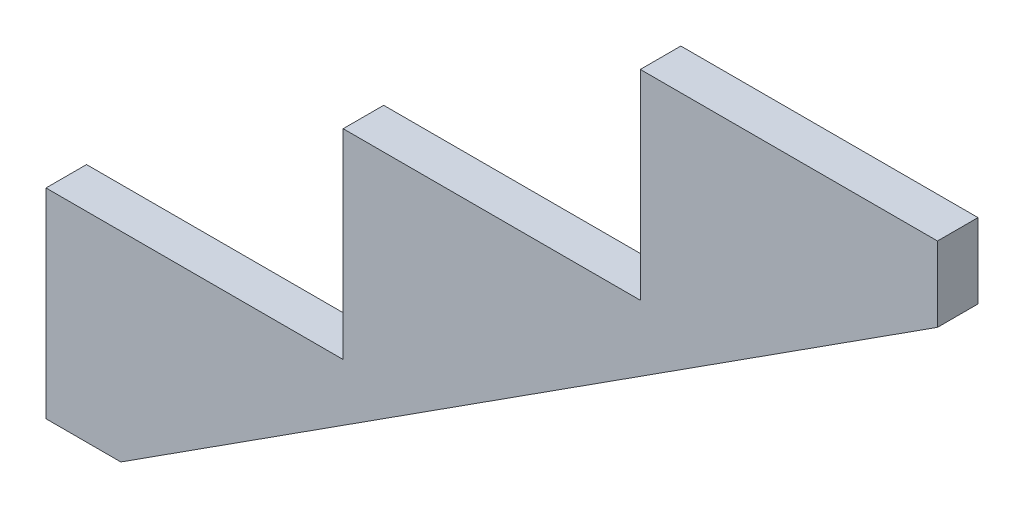
ISO-10303-21;
HEADER;
FILE_DESCRIPTION(('STEP AP214'),'2;1');
FILE_NAME('part.step','',(''),(''),'','','');
FILE_SCHEMA(('AUTOMOTIVE_DESIGN { 1 0 10303 214 1 1 1 1 }'));
ENDSEC;
DATA;
#1=APPLICATION_CONTEXT('core data for automotive mechanical design processes');
#2=APPLICATION_PROTOCOL_DEFINITION('international standard','automotive_design',2000,#1);
#3=PRODUCT_CONTEXT('',#1,'mechanical');
#4=PRODUCT('Part','Part','',(#3));
#5=PRODUCT_RELATED_PRODUCT_CATEGORY('part','',(#4));
#6=PRODUCT_DEFINITION_FORMATION('','',#4);
#7=PRODUCT_DEFINITION_CONTEXT('part definition',#1,'design');
#8=PRODUCT_DEFINITION('design','',#6,#7);
#9=PRODUCT_DEFINITION_SHAPE('','',#8);
#10=(LENGTH_UNIT() NAMED_UNIT(*) SI_UNIT(.MILLI.,.METRE.));
#11=(NAMED_UNIT(*) PLANE_ANGLE_UNIT() SI_UNIT($,.RADIAN.));
#12=(NAMED_UNIT(*) SI_UNIT($,.STERADIAN.) SOLID_ANGLE_UNIT());
#13=UNCERTAINTY_MEASURE_WITH_UNIT(LENGTH_MEASURE(1.E-05),#10,'distance_accuracy_value','');
#14=(GEOMETRIC_REPRESENTATION_CONTEXT(3) GLOBAL_UNCERTAINTY_ASSIGNED_CONTEXT((#13)) GLOBAL_UNIT_ASSIGNED_CONTEXT((#10,
#11,#12)) REPRESENTATION_CONTEXT('',''));
#15=CARTESIAN_POINT('',(0.,0.,0.));
#16=DIRECTION('',(0.,0.,1.));
#17=DIRECTION('',(1.,0.,0.));
#18=AXIS2_PLACEMENT_3D('',#15,#16,#17);
#19=CARTESIAN_POINT('',(0.,0.,38.1));
#20=DIRECTION('',(0.,1.,0.));
#21=DIRECTION('',(0.,0.,1.));
#22=AXIS2_PLACEMENT_3D('',#19,#20,#21);
#23=PLANE('',#22);
#24=DIRECTION('',(1.,0.,0.));
#25=VECTOR('',#24,1.);
#26=CARTESIAN_POINT('',(0.,0.,0.));
#27=LINE('',#26,#25);
#28=CARTESIAN_POINT('',(0.,0.,0.));
#29=VERTEX_POINT('',#28);
#30=CARTESIAN_POINT('',(70.3482964254288,0.,0.));
#31=VERTEX_POINT('',#30);
#32=EDGE_CURVE('E139',#29,#31,#27,.T.);
#33=ORIENTED_EDGE('',*,*,#32,.T.);
#34=DIRECTION('',(0.,0.,-1.));
#35=VECTOR('',#34,1.);
#36=CARTESIAN_POINT('',(70.3482964254288,0.,38.1));
#37=LINE('',#36,#35);
#38=CARTESIAN_POINT('',(70.3482964254288,0.,38.1));
#39=VERTEX_POINT('',#38);
#40=EDGE_CURVE('E11',#39,#31,#37,.T.);
#41=ORIENTED_EDGE('',*,*,#40,.F.);
#42=DIRECTION('',(1.,0.,0.));
#43=VECTOR('',#42,1.);
#44=CARTESIAN_POINT('',(0.,0.,38.1));
#45=LINE('',#44,#43);
#46=CARTESIAN_POINT('',(0.,0.,38.1));
#47=VERTEX_POINT('',#46);
#48=EDGE_CURVE('E155',#47,#39,#45,.T.);
#49=ORIENTED_EDGE('',*,*,#48,.F.);
#50=DIRECTION('',(0.,0.,-1.));
#51=VECTOR('',#50,1.);
#52=CARTESIAN_POINT('',(0.,0.,38.1));
#53=LINE('',#52,#51);
#54=EDGE_CURVE('E135',#47,#29,#53,.T.);
#55=ORIENTED_EDGE('',*,*,#54,.T.);
#56=EDGE_LOOP('',(#33,#41,#49,#55));
#57=FACE_BOUND('',#56,.T.);
#58=ADVANCED_FACE('F37',(#57),#23,.F.);
#59=CARTESIAN_POINT('',(70.3482964254288,0.,38.1));
#60=DIRECTION('',(-0.540689955011856,0.841221952013425,0.));
#61=DIRECTION('',(-0.841221952013425,-0.540689955011856,0.));
#62=AXIS2_PLACEMENT_3D('',#59,#60,#61);
#63=PLANE('',#62);
#64=DIRECTION('',(0.841221952013425,0.540689955011856,0.));
#65=VECTOR('',#64,1.);
#66=CARTESIAN_POINT('',(70.3482964254288,0.,0.));
#67=LINE('',#66,#65);
#68=CARTESIAN_POINT('',(838.2,493.531703574571,0.));
#69=VERTEX_POINT('',#68);
#70=EDGE_CURVE('E142',#31,#69,#67,.T.);
#71=ORIENTED_EDGE('',*,*,#70,.T.);
#72=DIRECTION('',(0.,0.,-1.));
#73=VECTOR('',#72,1.);
#74=CARTESIAN_POINT('',(838.2,493.531703574571,38.1));
#75=LINE('',#74,#73);
#76=CARTESIAN_POINT('',(838.2,493.531703574571,38.1));
#77=VERTEX_POINT('',#76);
#78=EDGE_CURVE('E45',#77,#69,#75,.T.);
#79=ORIENTED_EDGE('',*,*,#78,.F.);
#80=DIRECTION('',(0.841221952013425,0.540689955011856,0.));
#81=VECTOR('',#80,1.);
#82=CARTESIAN_POINT('',(70.3482964254288,0.,38.1));
#83=LINE('',#82,#81);
#84=EDGE_CURVE('E99',#39,#77,#83,.T.);
#85=ORIENTED_EDGE('',*,*,#84,.F.);
#86=ORIENTED_EDGE('',*,*,#40,.T.);
#87=EDGE_LOOP('',(#71,#79,#85,#86));
#88=FACE_BOUND('',#87,.T.);
#89=ADVANCED_FACE('F198',(#88),#63,.F.);
#90=CARTESIAN_POINT('',(838.2,493.531703574571,38.1));
#91=DIRECTION('',(-1.,0.,0.));
#92=DIRECTION('',(0.,0.,1.));
#93=AXIS2_PLACEMENT_3D('',#90,#91,#92);
#94=PLANE('',#93);
#95=DIRECTION('',(0.,1.,0.));
#96=VECTOR('',#95,1.);
#97=CARTESIAN_POINT('',(838.2,493.531703574571,0.));
#98=LINE('',#97,#96);
#99=CARTESIAN_POINT('',(838.2,563.88,0.));
#100=VERTEX_POINT('',#99);
#101=EDGE_CURVE('E144',#69,#100,#98,.T.);
#102=ORIENTED_EDGE('',*,*,#101,.T.);
#103=DIRECTION('',(0.,0.,-1.));
#104=VECTOR('',#103,1.);
#105=CARTESIAN_POINT('',(838.2,563.88,38.1));
#106=LINE('',#105,#104);
#107=CARTESIAN_POINT('',(838.2,563.88,38.1));
#108=VERTEX_POINT('',#107);
#109=EDGE_CURVE('E165',#108,#100,#106,.T.);
#110=ORIENTED_EDGE('',*,*,#109,.F.);
#111=DIRECTION('',(0.,1.,0.));
#112=VECTOR('',#111,1.);
#113=CARTESIAN_POINT('',(838.2,493.531703574571,38.1));
#114=LINE('',#113,#112);
#115=EDGE_CURVE('E173',#77,#108,#114,.T.);
#116=ORIENTED_EDGE('',*,*,#115,.F.);
#117=ORIENTED_EDGE('',*,*,#78,.T.);
#118=EDGE_LOOP('',(#102,#110,#116,#117));
#119=FACE_BOUND('',#118,.T.);
#120=ADVANCED_FACE('F171',(#119),#94,.F.);
#121=CARTESIAN_POINT('',(558.8,563.88,38.1));
#122=DIRECTION('',(0.,-1.,0.));
#123=DIRECTION('',(0.,0.,-1.));
#124=AXIS2_PLACEMENT_3D('',#121,#122,#123);
#125=PLANE('',#124);
#126=DIRECTION('',(-1.,0.,0.));
#127=VECTOR('',#126,1.);
#128=CARTESIAN_POINT('',(558.8,563.88,0.));
#129=LINE('',#128,#127);
#130=CARTESIAN_POINT('',(558.8,563.88,0.));
#131=VERTEX_POINT('',#130);
#132=EDGE_CURVE('E146',#100,#131,#129,.T.);
#133=ORIENTED_EDGE('',*,*,#132,.T.);
#134=DIRECTION('',(0.,0.,-1.));
#135=VECTOR('',#134,1.);
#136=CARTESIAN_POINT('',(558.8,563.88,38.1));
#137=LINE('',#136,#135);
#138=CARTESIAN_POINT('',(558.8,563.88,38.1));
#139=VERTEX_POINT('',#138);
#140=EDGE_CURVE('E162',#139,#131,#137,.T.);
#141=ORIENTED_EDGE('',*,*,#140,.F.);
#142=DIRECTION('',(-1.,0.,0.));
#143=VECTOR('',#142,1.);
#144=CARTESIAN_POINT('',(558.8,563.88,38.1));
#145=LINE('',#144,#143);
#146=EDGE_CURVE('E189',#108,#139,#145,.T.);
#147=ORIENTED_EDGE('',*,*,#146,.F.);
#148=ORIENTED_EDGE('',*,*,#109,.T.);
#149=EDGE_LOOP('',(#133,#141,#147,#148));
#150=FACE_BOUND('',#149,.T.);
#151=ADVANCED_FACE('F182',(#150),#125,.F.);
#152=CARTESIAN_POINT('',(558.8,375.92,38.1));
#153=DIRECTION('',(1.,0.,0.));
#154=DIRECTION('',(0.,0.,-1.));
#155=AXIS2_PLACEMENT_3D('',#152,#153,#154);
#156=PLANE('',#155);
#157=DIRECTION('',(0.,-1.,0.));
#158=VECTOR('',#157,1.);
#159=CARTESIAN_POINT('',(558.8,375.92,0.));
#160=LINE('',#159,#158);
#161=CARTESIAN_POINT('',(558.8,375.92,0.));
#162=VERTEX_POINT('',#161);
#163=EDGE_CURVE('E148',#131,#162,#160,.T.);
#164=ORIENTED_EDGE('',*,*,#163,.T.);
#165=DIRECTION('',(0.,0.,-1.));
#166=VECTOR('',#165,1.);
#167=CARTESIAN_POINT('',(558.8,375.92,38.1));
#168=LINE('',#167,#166);
#169=CARTESIAN_POINT('',(558.8,375.92,38.1));
#170=VERTEX_POINT('',#169);
#171=EDGE_CURVE('E159',#170,#162,#168,.T.);
#172=ORIENTED_EDGE('',*,*,#171,.F.);
#173=DIRECTION('',(0.,-1.,0.));
#174=VECTOR('',#173,1.);
#175=CARTESIAN_POINT('',(558.8,375.92,38.1));
#176=LINE('',#175,#174);
#177=EDGE_CURVE('E188',#139,#170,#176,.T.);
#178=ORIENTED_EDGE('',*,*,#177,.F.);
#179=ORIENTED_EDGE('',*,*,#140,.T.);
#180=EDGE_LOOP('',(#164,#172,#178,#179));
#181=FACE_BOUND('',#180,.T.);
#182=ADVANCED_FACE('F186',(#181),#156,.F.);
#183=CARTESIAN_POINT('',(279.4,375.92,38.1));
#184=DIRECTION('',(0.,-1.,0.));
#185=DIRECTION('',(0.,0.,-1.));
#186=AXIS2_PLACEMENT_3D('',#183,#184,#185);
#187=PLANE('',#186);
#188=DIRECTION('',(-1.,0.,0.));
#189=VECTOR('',#188,1.);
#190=CARTESIAN_POINT('',(279.4,375.92,0.));
#191=LINE('',#190,#189);
#192=CARTESIAN_POINT('',(279.4,375.92,0.));
#193=VERTEX_POINT('',#192);
#194=EDGE_CURVE('E150',#162,#193,#191,.T.);
#195=ORIENTED_EDGE('',*,*,#194,.T.);
#196=DIRECTION('',(0.,0.,-1.));
#197=VECTOR('',#196,1.);
#198=CARTESIAN_POINT('',(279.4,375.92,38.1));
#199=LINE('',#198,#197);
#200=CARTESIAN_POINT('',(279.4,375.92,38.1));
#201=VERTEX_POINT('',#200);
#202=EDGE_CURVE('E130',#201,#193,#199,.T.);
#203=ORIENTED_EDGE('',*,*,#202,.F.);
#204=DIRECTION('',(-1.,0.,0.));
#205=VECTOR('',#204,1.);
#206=CARTESIAN_POINT('',(279.4,375.92,38.1));
#207=LINE('',#206,#205);
#208=EDGE_CURVE('E121',#170,#201,#207,.T.);
#209=ORIENTED_EDGE('',*,*,#208,.F.);
#210=ORIENTED_EDGE('',*,*,#171,.T.);
#211=EDGE_LOOP('',(#195,#203,#209,#210));
#212=FACE_BOUND('',#211,.T.);
#213=ADVANCED_FACE('F210',(#212),#187,.F.);
#214=CARTESIAN_POINT('',(279.4,187.96,38.1));
#215=DIRECTION('',(1.,0.,0.));
#216=DIRECTION('',(0.,0.,-1.));
#217=AXIS2_PLACEMENT_3D('',#214,#215,#216);
#218=PLANE('',#217);
#219=DIRECTION('',(0.,-1.,0.));
#220=VECTOR('',#219,1.);
#221=CARTESIAN_POINT('',(279.4,187.96,0.));
#222=LINE('',#221,#220);
#223=CARTESIAN_POINT('',(279.4,187.96,0.));
#224=VERTEX_POINT('',#223);
#225=EDGE_CURVE('E129',#193,#224,#222,.T.);
#226=ORIENTED_EDGE('',*,*,#225,.T.);
#227=DIRECTION('',(0.,0.,-1.));
#228=VECTOR('',#227,1.);
#229=CARTESIAN_POINT('',(279.4,187.96,38.1));
#230=LINE('',#229,#228);
#231=CARTESIAN_POINT('',(279.4,187.96,38.1));
#232=VERTEX_POINT('',#231);
#233=EDGE_CURVE('E126',#232,#224,#230,.T.);
#234=ORIENTED_EDGE('',*,*,#233,.F.);
#235=DIRECTION('',(0.,-1.,0.));
#236=VECTOR('',#235,1.);
#237=CARTESIAN_POINT('',(279.4,187.96,38.1));
#238=LINE('',#237,#236);
#239=EDGE_CURVE('E115',#201,#232,#238,.T.);
#240=ORIENTED_EDGE('',*,*,#239,.F.);
#241=ORIENTED_EDGE('',*,*,#202,.T.);
#242=EDGE_LOOP('',(#226,#234,#240,#241));
#243=FACE_BOUND('',#242,.T.);
#244=ADVANCED_FACE('F127',(#243),#218,.F.);
#245=CARTESIAN_POINT('',(0.,187.96,38.1));
#246=DIRECTION('',(0.,-1.,0.));
#247=DIRECTION('',(0.,0.,-1.));
#248=AXIS2_PLACEMENT_3D('',#245,#246,#247);
#249=PLANE('',#248);
#250=DIRECTION('',(-1.,0.,0.));
#251=VECTOR('',#250,1.);
#252=CARTESIAN_POINT('',(0.,187.96,0.));
#253=LINE('',#252,#251);
#254=CARTESIAN_POINT('',(0.,187.96,0.));
#255=VERTEX_POINT('',#254);
#256=EDGE_CURVE('E85',#224,#255,#253,.T.);
#257=ORIENTED_EDGE('',*,*,#256,.T.);
#258=DIRECTION('',(0.,0.,-1.));
#259=VECTOR('',#258,1.);
#260=CARTESIAN_POINT('',(0.,187.96,38.1));
#261=LINE('',#260,#259);
#262=CARTESIAN_POINT('',(0.,187.96,38.1));
#263=VERTEX_POINT('',#262);
#264=EDGE_CURVE('E131',#263,#255,#261,.T.);
#265=ORIENTED_EDGE('',*,*,#264,.F.);
#266=DIRECTION('',(-1.,0.,0.));
#267=VECTOR('',#266,1.);
#268=CARTESIAN_POINT('',(0.,187.96,38.1));
#269=LINE('',#268,#267);
#270=EDGE_CURVE('E119',#232,#263,#269,.T.);
#271=ORIENTED_EDGE('',*,*,#270,.F.);
#272=ORIENTED_EDGE('',*,*,#233,.T.);
#273=EDGE_LOOP('',(#257,#265,#271,#272));
#274=FACE_BOUND('',#273,.T.);
#275=ADVANCED_FACE('F133',(#274),#249,.F.);
#276=CARTESIAN_POINT('',(0.,187.96,38.1));
#277=DIRECTION('',(1.,0.,0.));
#278=DIRECTION('',(0.,0.,-1.));
#279=AXIS2_PLACEMENT_3D('',#276,#277,#278);
#280=PLANE('',#279);
#281=DIRECTION('',(0.,-1.,0.));
#282=VECTOR('',#281,1.);
#283=CARTESIAN_POINT('',(0.,187.96,0.));
#284=LINE('',#283,#282);
#285=EDGE_CURVE('E91',#255,#29,#284,.T.);
#286=ORIENTED_EDGE('',*,*,#285,.T.);
#287=ORIENTED_EDGE('',*,*,#54,.F.);
#288=DIRECTION('',(0.,-1.,0.));
#289=VECTOR('',#288,1.);
#290=CARTESIAN_POINT('',(0.,187.96,38.1));
#291=LINE('',#290,#289);
#292=EDGE_CURVE('E53',#263,#47,#291,.T.);
#293=ORIENTED_EDGE('',*,*,#292,.F.);
#294=ORIENTED_EDGE('',*,*,#264,.T.);
#295=EDGE_LOOP('',(#286,#287,#293,#294));
#296=FACE_BOUND('',#295,.T.);
#297=ADVANCED_FACE('F218',(#296),#280,.F.);
#298=CARTESIAN_POINT('',(0.,0.,38.1));
#299=DIRECTION('',(0.,0.,1.));
#300=DIRECTION('',(1.,0.,0.));
#301=AXIS2_PLACEMENT_3D('',#298,#299,#300);
#302=PLANE('',#301);
#303=ORIENTED_EDGE('',*,*,#48,.T.);
#304=ORIENTED_EDGE('',*,*,#84,.T.);
#305=ORIENTED_EDGE('',*,*,#115,.T.);
#306=ORIENTED_EDGE('',*,*,#146,.T.);
#307=ORIENTED_EDGE('',*,*,#177,.T.);
#308=ORIENTED_EDGE('',*,*,#208,.T.);
#309=ORIENTED_EDGE('',*,*,#239,.T.);
#310=ORIENTED_EDGE('',*,*,#270,.T.);
#311=ORIENTED_EDGE('',*,*,#292,.T.);
#312=EDGE_LOOP('',(#303,#304,#305,#306,#307,#308,#309,#310,#311));
#313=FACE_BOUND('',#312,.T.);
#314=ADVANCED_FACE('F117',(#313),#302,.T.);
#315=CARTESIAN_POINT('',(0.,0.,0.));
#316=DIRECTION('',(0.,0.,1.));
#317=DIRECTION('',(1.,0.,0.));
#318=AXIS2_PLACEMENT_3D('',#315,#316,#317);
#319=PLANE('',#318);
#320=ORIENTED_EDGE('',*,*,#32,.F.);
#321=ORIENTED_EDGE('',*,*,#285,.F.);
#322=ORIENTED_EDGE('',*,*,#256,.F.);
#323=ORIENTED_EDGE('',*,*,#225,.F.);
#324=ORIENTED_EDGE('',*,*,#194,.F.);
#325=ORIENTED_EDGE('',*,*,#163,.F.);
#326=ORIENTED_EDGE('',*,*,#132,.F.);
#327=ORIENTED_EDGE('',*,*,#101,.F.);
#328=ORIENTED_EDGE('',*,*,#70,.F.);
#329=EDGE_LOOP('',(#320,#321,#322,#323,#324,#325,#326,#327,#328));
#330=FACE_BOUND('',#329,.T.);
#331=ADVANCED_FACE('F177',(#330),#319,.F.);
#332=CLOSED_SHELL('',(#58,#89,#120,#151,#182,#213,#244,#275,#297,#314,#331));
#333=MANIFOLD_SOLID_BREP('B2',#332);
#334=ADVANCED_BREP_SHAPE_REPRESENTATION('',(#18,#333),#14);
#335=SHAPE_DEFINITION_REPRESENTATION(#9,#334);
ENDSEC;
END-ISO-10303-21;
